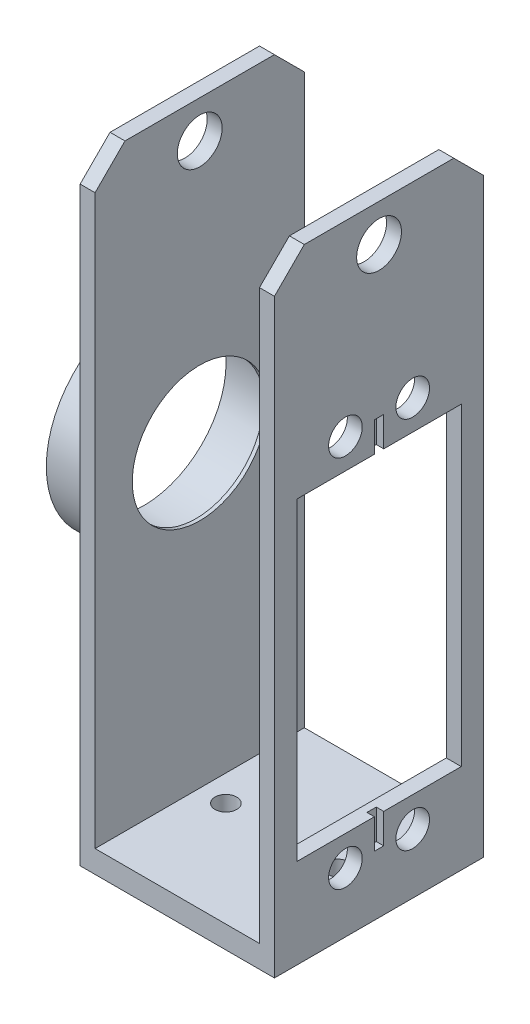
ISO-10303-21;
HEADER;
FILE_DESCRIPTION(('STEP AP214'),'2;1');
FILE_NAME('part.step','',(''),(''),'','','');
FILE_SCHEMA(('AUTOMOTIVE_DESIGN { 1 0 10303 214 1 1 1 1 }'));
ENDSEC;
DATA;
#1=APPLICATION_CONTEXT('core data for automotive mechanical design processes');
#2=APPLICATION_PROTOCOL_DEFINITION('international standard','automotive_design',2000,#1);
#3=PRODUCT_CONTEXT('',#1,'mechanical');
#4=PRODUCT('Part','Part','',(#3));
#5=PRODUCT_RELATED_PRODUCT_CATEGORY('part','',(#4));
#6=PRODUCT_DEFINITION_FORMATION('','',#4);
#7=PRODUCT_DEFINITION_CONTEXT('part definition',#1,'design');
#8=PRODUCT_DEFINITION('design','',#6,#7);
#9=PRODUCT_DEFINITION_SHAPE('','',#8);
#10=(LENGTH_UNIT() NAMED_UNIT(*) SI_UNIT(.MILLI.,.METRE.));
#11=(NAMED_UNIT(*) PLANE_ANGLE_UNIT() SI_UNIT($,.RADIAN.));
#12=(NAMED_UNIT(*) SI_UNIT($,.STERADIAN.) SOLID_ANGLE_UNIT());
#13=UNCERTAINTY_MEASURE_WITH_UNIT(LENGTH_MEASURE(1.E-05),#10,'distance_accuracy_value','');
#14=(GEOMETRIC_REPRESENTATION_CONTEXT(3) GLOBAL_UNCERTAINTY_ASSIGNED_CONTEXT((#13)) GLOBAL_UNIT_ASSIGNED_CONTEXT((#10,
#11,#12)) REPRESENTATION_CONTEXT('',''));
#15=CARTESIAN_POINT('',(0.,0.,0.));
#16=DIRECTION('',(0.,0.,1.));
#17=DIRECTION('',(1.,0.,0.));
#18=AXIS2_PLACEMENT_3D('',#15,#16,#17);
#19=CARTESIAN_POINT('',(13.,0.,0.));
#20=DIRECTION('',(1.,0.,0.));
#21=DIRECTION('',(0.,0.,-1.));
#22=AXIS2_PLACEMENT_3D('',#19,#20,#21);
#23=PLANE('',#22);
#24=CARTESIAN_POINT('',(13.,78.,0.));
#25=DIRECTION('',(-1.,0.,0.));
#26=DIRECTION('',(0.,0.,1.));
#27=AXIS2_PLACEMENT_3D('',#24,#25,#26);
#28=CIRCLE('',#27,3.);
#29=CARTESIAN_POINT('',(13.,78.,3.));
#30=VERTEX_POINT('',#29);
#31=EDGE_CURVE('E415',#30,#30,#28,.T.);
#32=ORIENTED_EDGE('',*,*,#31,.T.);
#33=EDGE_LOOP('',(#32));
#34=FACE_BOUND('',#33,.T.);
#35=CARTESIAN_POINT('',(13.,8.,4.50000000000001));
#36=DIRECTION('',(1.,0.,0.));
#37=DIRECTION('',(0.,0.,-1.));
#38=AXIS2_PLACEMENT_3D('',#35,#36,#37);
#39=CIRCLE('',#38,2.25);
#40=CARTESIAN_POINT('',(13.,8.,2.25000000000001));
#41=VERTEX_POINT('',#40);
#42=EDGE_CURVE('E353',#41,#41,#39,.T.);
#43=ORIENTED_EDGE('',*,*,#42,.F.);
#44=EDGE_LOOP('',(#43));
#45=FACE_BOUND('',#44,.T.);
#46=CARTESIAN_POINT('',(13.,58.,4.5));
#47=DIRECTION('',(1.,0.,0.));
#48=DIRECTION('',(0.,0.,-1.));
#49=AXIS2_PLACEMENT_3D('',#46,#47,#48);
#50=CIRCLE('',#49,2.25000000000001);
#51=CARTESIAN_POINT('',(13.,58.,2.25));
#52=VERTEX_POINT('',#51);
#53=EDGE_CURVE('E403',#52,#52,#50,.T.);
#54=ORIENTED_EDGE('',*,*,#53,.F.);
#55=EDGE_LOOP('',(#54));
#56=FACE_BOUND('',#55,.T.);
#57=CARTESIAN_POINT('',(13.,58.,-4.5));
#58=DIRECTION('',(1.,0.,0.));
#59=DIRECTION('',(0.,0.,-1.));
#60=AXIS2_PLACEMENT_3D('',#57,#58,#59);
#61=CIRCLE('',#60,2.25000000000001);
#62=CARTESIAN_POINT('',(13.,58.,-6.75));
#63=VERTEX_POINT('',#62);
#64=EDGE_CURVE('E388',#63,#63,#61,.T.);
#65=ORIENTED_EDGE('',*,*,#64,.F.);
#66=EDGE_LOOP('',(#65));
#67=FACE_BOUND('',#66,.T.);
#68=CARTESIAN_POINT('',(13.,8.,-4.49999999999999));
#69=DIRECTION('',(1.,0.,0.));
#70=DIRECTION('',(0.,0.,-1.));
#71=AXIS2_PLACEMENT_3D('',#68,#69,#70);
#72=CIRCLE('',#71,2.25);
#73=CARTESIAN_POINT('',(13.,8.,-6.74999999999999));
#74=VERTEX_POINT('',#73);
#75=EDGE_CURVE('E334',#74,#74,#72,.T.);
#76=ORIENTED_EDGE('',*,*,#75,.F.);
#77=EDGE_LOOP('',(#76));
#78=FACE_BOUND('',#77,.T.);
#79=DIRECTION('',(0.,1.,0.));
#80=VECTOR('',#79,1.);
#81=CARTESIAN_POINT('',(13.,0.,-14.));
#82=LINE('',#81,#80);
#83=CARTESIAN_POINT('',(13.,0.,-14.));
#84=VERTEX_POINT('',#83);
#85=CARTESIAN_POINT('',(13.,79.,-14.));
#86=VERTEX_POINT('',#85);
#87=EDGE_CURVE('E342',#84,#86,#82,.T.);
#88=ORIENTED_EDGE('',*,*,#87,.T.);
#89=DIRECTION('',(0.,0.70710678118655,0.707106781186545));
#90=VECTOR('',#89,1.);
#91=CARTESIAN_POINT('',(13.,46.4999999999997,-46.5));
#92=LINE('',#91,#90);
#93=CARTESIAN_POINT('',(13.,83.,-10.));
#94=VERTEX_POINT('',#93);
#95=EDGE_CURVE('E431',#86,#94,#92,.T.);
#96=ORIENTED_EDGE('',*,*,#95,.T.);
#97=DIRECTION('',(0.,0.,-1.));
#98=VECTOR('',#97,1.);
#99=CARTESIAN_POINT('',(13.,83.,0.));
#100=LINE('',#99,#98);
#101=CARTESIAN_POINT('',(13.,83.,9.99999999999997));
#102=VERTEX_POINT('',#101);
#103=EDGE_CURVE('E345',#102,#94,#100,.T.);
#104=ORIENTED_EDGE('',*,*,#103,.F.);
#105=DIRECTION('',(0.,0.707106781186546,-0.707106781186549));
#106=VECTOR('',#105,1.);
#107=CARTESIAN_POINT('',(13.,46.5000000000001,46.5));
#108=LINE('',#107,#106);
#109=CARTESIAN_POINT('',(13.,79.,14.));
#110=VERTEX_POINT('',#109);
#111=EDGE_CURVE('E429',#102,#110,#108,.F.);
#112=ORIENTED_EDGE('',*,*,#111,.T.);
#113=DIRECTION('',(0.,1.,0.));
#114=VECTOR('',#113,1.);
#115=CARTESIAN_POINT('',(13.,0.,14.));
#116=LINE('',#115,#114);
#117=CARTESIAN_POINT('',(13.,0.,14.));
#118=VERTEX_POINT('',#117);
#119=EDGE_CURVE('E335',#118,#110,#116,.T.);
#120=ORIENTED_EDGE('',*,*,#119,.F.);
#121=DIRECTION('',(0.,0.,-1.));
#122=VECTOR('',#121,1.);
#123=CARTESIAN_POINT('',(13.,0.,0.));
#124=LINE('',#123,#122);
#125=EDGE_CURVE('E338',#118,#84,#124,.T.);
#126=ORIENTED_EDGE('',*,*,#125,.T.);
#127=EDGE_LOOP('',(#88,#96,#104,#112,#120,#126));
#128=FACE_BOUND('',#127,.T.);
#129=DIRECTION('',(0.,0.,1.));
#130=VECTOR('',#129,1.);
#131=CARTESIAN_POINT('',(13.,54.,0.));
#132=LINE('',#131,#130);
#133=CARTESIAN_POINT('',(13.,54.,0.625000000000005));
#134=VERTEX_POINT('',#133);
#135=CARTESIAN_POINT('',(13.,54.,11.));
#136=VERTEX_POINT('',#135);
#137=EDGE_CURVE('E391',#134,#136,#132,.T.);
#138=ORIENTED_EDGE('',*,*,#137,.F.);
#139=DIRECTION('',(0.,1.,0.));
#140=VECTOR('',#139,1.);
#141=CARTESIAN_POINT('',(13.,0.,0.625000000000005));
#142=LINE('',#141,#140);
#143=CARTESIAN_POINT('',(13.,58.,0.625000000000005));
#144=VERTEX_POINT('',#143);
#145=EDGE_CURVE('E259',#134,#144,#142,.T.);
#146=ORIENTED_EDGE('',*,*,#145,.T.);
#147=DIRECTION('',(0.,0.,1.));
#148=VECTOR('',#147,1.);
#149=CARTESIAN_POINT('',(13.,58.,0.));
#150=LINE('',#149,#148);
#151=CARTESIAN_POINT('',(13.,58.,-0.624999999999995));
#152=VERTEX_POINT('',#151);
#153=EDGE_CURVE('E581',#152,#144,#150,.T.);
#154=ORIENTED_EDGE('',*,*,#153,.F.);
#155=DIRECTION('',(0.,1.,0.));
#156=VECTOR('',#155,1.);
#157=CARTESIAN_POINT('',(13.,0.,-0.624999999999995));
#158=LINE('',#157,#156);
#159=CARTESIAN_POINT('',(13.,54.,-0.624999999999995));
#160=VERTEX_POINT('',#159);
#161=EDGE_CURVE('E579',#160,#152,#158,.T.);
#162=ORIENTED_EDGE('',*,*,#161,.F.);
#163=CARTESIAN_POINT('',(13.,54.,-11.));
#164=VERTEX_POINT('',#163);
#165=EDGE_CURVE('E230',#164,#160,#132,.T.);
#166=ORIENTED_EDGE('',*,*,#165,.F.);
#167=DIRECTION('',(0.,-1.,0.));
#168=VECTOR('',#167,1.);
#169=CARTESIAN_POINT('',(13.,0.,-11.));
#170=LINE('',#169,#168);
#171=CARTESIAN_POINT('',(13.,12.,-11.));
#172=VERTEX_POINT('',#171);
#173=EDGE_CURVE('E393',#164,#172,#170,.T.);
#174=ORIENTED_EDGE('',*,*,#173,.T.);
#175=DIRECTION('',(0.,0.,1.));
#176=VECTOR('',#175,1.);
#177=CARTESIAN_POINT('',(13.,12.,0.));
#178=LINE('',#177,#176);
#179=CARTESIAN_POINT('',(13.,12.,-0.625000000000001));
#180=VERTEX_POINT('',#179);
#181=EDGE_CURVE('E397',#172,#180,#178,.T.);
#182=ORIENTED_EDGE('',*,*,#181,.T.);
#183=DIRECTION('',(0.,-1.,0.));
#184=VECTOR('',#183,1.);
#185=CARTESIAN_POINT('',(13.,12.,-0.625000000000001));
#186=LINE('',#185,#184);
#187=CARTESIAN_POINT('',(13.,8.,-0.625000000000002));
#188=VERTEX_POINT('',#187);
#189=EDGE_CURVE('E249',#180,#188,#186,.T.);
#190=ORIENTED_EDGE('',*,*,#189,.T.);
#191=DIRECTION('',(0.,0.,1.));
#192=VECTOR('',#191,1.);
#193=CARTESIAN_POINT('',(13.,8.,-0.625000000000002));
#194=LINE('',#193,#192);
#195=CARTESIAN_POINT('',(13.,8.,0.624999999999998));
#196=VERTEX_POINT('',#195);
#197=EDGE_CURVE('E252',#188,#196,#194,.T.);
#198=ORIENTED_EDGE('',*,*,#197,.T.);
#199=DIRECTION('',(0.,-1.,0.));
#200=VECTOR('',#199,1.);
#201=CARTESIAN_POINT('',(13.,12.,0.624999999999999));
#202=LINE('',#201,#200);
#203=CARTESIAN_POINT('',(13.,12.,0.624999999999999));
#204=VERTEX_POINT('',#203);
#205=EDGE_CURVE('E256',#204,#196,#202,.T.);
#206=ORIENTED_EDGE('',*,*,#205,.F.);
#207=CARTESIAN_POINT('',(13.,12.,11.));
#208=VERTEX_POINT('',#207);
#209=EDGE_CURVE('E396',#204,#208,#178,.T.);
#210=ORIENTED_EDGE('',*,*,#209,.T.);
#211=DIRECTION('',(0.,-1.,0.));
#212=VECTOR('',#211,1.);
#213=CARTESIAN_POINT('',(13.,0.,11.));
#214=LINE('',#213,#212);
#215=EDGE_CURVE('E383',#136,#208,#214,.T.);
#216=ORIENTED_EDGE('',*,*,#215,.F.);
#217=EDGE_LOOP('',(#138,#146,#154,#162,#166,#174,#182,#190,#198,#206,#210,#216));
#218=FACE_BOUND('',#217,.T.);
#219=ADVANCED_FACE('F45',(#34,#45,#56,#67,#78,#128,#218),#23,.T.);
#220=CARTESIAN_POINT('',(21.,12.,11.));
#221=DIRECTION('',(0.,1.,0.));
#222=DIRECTION('',(0.,0.,1.));
#223=AXIS2_PLACEMENT_3D('',#220,#221,#222);
#224=PLANE('',#223);
#225=DIRECTION('',(0.,0.,1.));
#226=VECTOR('',#225,1.);
#227=CARTESIAN_POINT('',(12.,12.,-0.625000000000001));
#228=LINE('',#227,#226);
#229=CARTESIAN_POINT('',(12.,12.,-0.625000000000002));
#230=VERTEX_POINT('',#229);
#231=CARTESIAN_POINT('',(12.,12.,0.624999999999999));
#232=VERTEX_POINT('',#231);
#233=EDGE_CURVE('E253',#230,#232,#228,.T.);
#234=ORIENTED_EDGE('',*,*,#233,.F.);
#235=DIRECTION('',(1.,0.,0.));
#236=VECTOR('',#235,1.);
#237=CARTESIAN_POINT('',(12.,12.,-0.625000000000001));
#238=LINE('',#237,#236);
#239=EDGE_CURVE('E245',#230,#180,#238,.T.);
#240=ORIENTED_EDGE('',*,*,#239,.T.);
#241=ORIENTED_EDGE('',*,*,#181,.F.);
#242=DIRECTION('',(-1.,0.,0.));
#243=VECTOR('',#242,1.);
#244=CARTESIAN_POINT('',(21.,12.,-11.));
#245=LINE('',#244,#243);
#246=CARTESIAN_POINT('',(11.,12.,-11.));
#247=VERTEX_POINT('',#246);
#248=EDGE_CURVE('E295',#172,#247,#245,.T.);
#249=ORIENTED_EDGE('',*,*,#248,.T.);
#250=DIRECTION('',(0.,0.,-1.));
#251=VECTOR('',#250,1.);
#252=CARTESIAN_POINT('',(11.,12.,11.));
#253=LINE('',#252,#251);
#254=CARTESIAN_POINT('',(11.,12.,11.));
#255=VERTEX_POINT('',#254);
#256=EDGE_CURVE('E306',#255,#247,#253,.T.);
#257=ORIENTED_EDGE('',*,*,#256,.F.);
#258=DIRECTION('',(-1.,0.,0.));
#259=VECTOR('',#258,1.);
#260=CARTESIAN_POINT('',(21.,12.,11.));
#261=LINE('',#260,#259);
#262=EDGE_CURVE('E312',#208,#255,#261,.T.);
#263=ORIENTED_EDGE('',*,*,#262,.F.);
#264=ORIENTED_EDGE('',*,*,#209,.F.);
#265=DIRECTION('',(1.,0.,0.));
#266=VECTOR('',#265,1.);
#267=CARTESIAN_POINT('',(12.,12.,0.624999999999999));
#268=LINE('',#267,#266);
#269=EDGE_CURVE('E238',#232,#204,#268,.T.);
#270=ORIENTED_EDGE('',*,*,#269,.F.);
#271=EDGE_LOOP('',(#234,#240,#241,#249,#257,#263,#264,#270));
#272=FACE_BOUND('',#271,.T.);
#273=ADVANCED_FACE('F478',(#272),#224,.T.);
#274=CARTESIAN_POINT('',(21.,54.,11.));
#275=DIRECTION('',(0.,1.,0.));
#276=DIRECTION('',(-1.,0.,0.));
#277=AXIS2_PLACEMENT_3D('',#274,#275,#276);
#278=PLANE('',#277);
#279=DIRECTION('',(1.,0.,0.));
#280=VECTOR('',#279,1.);
#281=CARTESIAN_POINT('',(12.,54.,0.625000000000005));
#282=LINE('',#281,#280);
#283=CARTESIAN_POINT('',(12.,54.,0.625000000000006));
#284=VERTEX_POINT('',#283);
#285=EDGE_CURVE('E231',#284,#134,#282,.T.);
#286=ORIENTED_EDGE('',*,*,#285,.T.);
#287=ORIENTED_EDGE('',*,*,#137,.T.);
#288=DIRECTION('',(-1.,0.,0.));
#289=VECTOR('',#288,1.);
#290=CARTESIAN_POINT('',(21.,54.,11.));
#291=LINE('',#290,#289);
#292=CARTESIAN_POINT('',(11.,54.,11.));
#293=VERTEX_POINT('',#292);
#294=EDGE_CURVE('E310',#136,#293,#291,.T.);
#295=ORIENTED_EDGE('',*,*,#294,.T.);
#296=DIRECTION('',(0.,0.,-1.));
#297=VECTOR('',#296,1.);
#298=CARTESIAN_POINT('',(11.,54.,11.));
#299=LINE('',#298,#297);
#300=CARTESIAN_POINT('',(11.,54.,-11.));
#301=VERTEX_POINT('',#300);
#302=EDGE_CURVE('E318',#293,#301,#299,.T.);
#303=ORIENTED_EDGE('',*,*,#302,.T.);
#304=DIRECTION('',(-1.,0.,0.));
#305=VECTOR('',#304,1.);
#306=CARTESIAN_POINT('',(21.,54.,-11.));
#307=LINE('',#306,#305);
#308=EDGE_CURVE('E308',#164,#301,#307,.T.);
#309=ORIENTED_EDGE('',*,*,#308,.F.);
#310=ORIENTED_EDGE('',*,*,#165,.T.);
#311=DIRECTION('',(1.,0.,0.));
#312=VECTOR('',#311,1.);
#313=CARTESIAN_POINT('',(12.,54.,-0.624999999999995));
#314=LINE('',#313,#312);
#315=CARTESIAN_POINT('',(12.,54.,-0.624999999999995));
#316=VERTEX_POINT('',#315);
#317=EDGE_CURVE('E210',#316,#160,#314,.T.);
#318=ORIENTED_EDGE('',*,*,#317,.F.);
#319=DIRECTION('',(0.,0.,-1.));
#320=VECTOR('',#319,1.);
#321=CARTESIAN_POINT('',(12.,54.,0.));
#322=LINE('',#321,#320);
#323=EDGE_CURVE('E217',#284,#316,#322,.T.);
#324=ORIENTED_EDGE('',*,*,#323,.F.);
#325=EDGE_LOOP('',(#286,#287,#295,#303,#309,#310,#318,#324));
#326=FACE_BOUND('',#325,.T.);
#327=ADVANCED_FACE('F227',(#326),#278,.F.);
#328=CARTESIAN_POINT('',(-13.,0.,0.));
#329=DIRECTION('',(-1.,0.,0.));
#330=DIRECTION('',(0.,0.,-1.));
#331=AXIS2_PLACEMENT_3D('',#328,#329,#330);
#332=PLANE('',#331);
#333=CARTESIAN_POINT('',(-13.,78.,0.));
#334=DIRECTION('',(-1.,0.,0.));
#335=DIRECTION('',(0.,0.,1.));
#336=AXIS2_PLACEMENT_3D('',#333,#334,#335);
#337=CIRCLE('',#336,3.);
#338=CARTESIAN_POINT('',(-13.,78.,3.));
#339=VERTEX_POINT('',#338);
#340=EDGE_CURVE('E248',#339,#339,#337,.T.);
#341=ORIENTED_EDGE('',*,*,#340,.F.);
#342=EDGE_LOOP('',(#341));
#343=FACE_BOUND('',#342,.T.);
#344=DIRECTION('',(0.,0.,-1.));
#345=VECTOR('',#344,1.);
#346=CARTESIAN_POINT('',(-13.,83.,0.));
#347=LINE('',#346,#345);
#348=CARTESIAN_POINT('',(-13.,83.,10.));
#349=VERTEX_POINT('',#348);
#350=CARTESIAN_POINT('',(-13.,83.,-9.99999999999997));
#351=VERTEX_POINT('',#350);
#352=EDGE_CURVE('E286',#349,#351,#347,.T.);
#353=ORIENTED_EDGE('',*,*,#352,.T.);
#354=DIRECTION('',(0.,0.707106781186546,0.707106781186549));
#355=VECTOR('',#354,1.);
#356=CARTESIAN_POINT('',(-13.,46.5000000000001,-46.5));
#357=LINE('',#356,#355);
#358=CARTESIAN_POINT('',(-13.,79.,-14.));
#359=VERTEX_POINT('',#358);
#360=EDGE_CURVE('E12',#351,#359,#357,.F.);
#361=ORIENTED_EDGE('',*,*,#360,.T.);
#362=DIRECTION('',(0.,1.,0.));
#363=VECTOR('',#362,1.);
#364=CARTESIAN_POINT('',(-13.,0.,-14.));
#365=LINE('',#364,#363);
#366=CARTESIAN_POINT('',(-13.,0.,-14.));
#367=VERTEX_POINT('',#366);
#368=EDGE_CURVE('E289',#367,#359,#365,.T.);
#369=ORIENTED_EDGE('',*,*,#368,.F.);
#370=DIRECTION('',(0.,0.,-1.));
#371=VECTOR('',#370,1.);
#372=CARTESIAN_POINT('',(-13.,0.,0.));
#373=LINE('',#372,#371);
#374=CARTESIAN_POINT('',(-13.,0.,14.));
#375=VERTEX_POINT('',#374);
#376=EDGE_CURVE('E292',#375,#367,#373,.T.);
#377=ORIENTED_EDGE('',*,*,#376,.F.);
#378=DIRECTION('',(0.,1.,0.));
#379=VECTOR('',#378,1.);
#380=CARTESIAN_POINT('',(-13.,0.,14.));
#381=LINE('',#380,#379);
#382=CARTESIAN_POINT('',(-13.,79.,14.));
#383=VERTEX_POINT('',#382);
#384=EDGE_CURVE('E284',#375,#383,#381,.T.);
#385=ORIENTED_EDGE('',*,*,#384,.T.);
#386=DIRECTION('',(0.,0.70710678118655,-0.707106781186545));
#387=VECTOR('',#386,1.);
#388=CARTESIAN_POINT('',(-13.,46.4999999999997,46.5));
#389=LINE('',#388,#387);
#390=EDGE_CURVE('E53',#383,#349,#389,.T.);
#391=ORIENTED_EDGE('',*,*,#390,.T.);
#392=EDGE_LOOP('',(#353,#361,#369,#377,#385,#391));
#393=FACE_BOUND('',#392,.T.);
#394=CARTESIAN_POINT('',(-13.,43.,0.));
#395=DIRECTION('',(-1.,0.,0.));
#396=DIRECTION('',(0.,0.,1.));
#397=AXIS2_PLACEMENT_3D('',#394,#395,#396);
#398=CIRCLE('',#397,13.025);
#399=CARTESIAN_POINT('',(-13.,43.,13.025));
#400=VERTEX_POINT('',#399);
#401=EDGE_CURVE('E271',#400,#400,#398,.T.);
#402=ORIENTED_EDGE('',*,*,#401,.F.);
#403=EDGE_LOOP('',(#402));
#404=FACE_BOUND('',#403,.T.);
#405=ADVANCED_FACE('F462',(#343,#393,#404),#332,.T.);
#406=CARTESIAN_POINT('',(-21.,43.,0.));
#407=DIRECTION('',(1.,0.,0.));
#408=DIRECTION('',(0.,0.,-1.));
#409=AXIS2_PLACEMENT_3D('',#406,#407,#408);
#410=CYLINDRICAL_SURFACE('',#409,11.025);
#411=CARTESIAN_POINT('',(-11.5,43.,0.));
#412=DIRECTION('',(1.,0.,0.));
#413=DIRECTION('',(0.,0.,-1.));
#414=AXIS2_PLACEMENT_3D('',#411,#412,#413);
#415=CIRCLE('',#414,11.025);
#416=CARTESIAN_POINT('',(-11.5,43.,-11.025));
#417=VERTEX_POINT('',#416);
#418=EDGE_CURVE('E400',#417,#417,#415,.F.);
#419=ORIENTED_EDGE('',*,*,#418,.F.);
#420=EDGE_LOOP('',(#419));
#421=FACE_BOUND('',#420,.T.);
#422=CARTESIAN_POINT('',(-18.5,43.,0.));
#423=DIRECTION('',(-1.,0.,0.));
#424=DIRECTION('',(0.,0.,1.));
#425=AXIS2_PLACEMENT_3D('',#422,#423,#424);
#426=CIRCLE('',#425,11.025);
#427=CARTESIAN_POINT('',(-18.5,43.,11.025));
#428=VERTEX_POINT('',#427);
#429=EDGE_CURVE('E268',#428,#428,#426,.T.);
#430=ORIENTED_EDGE('',*,*,#429,.T.);
#431=EDGE_LOOP('',(#430));
#432=FACE_BOUND('',#431,.T.);
#433=ADVANCED_FACE('F495',(#421,#432),#410,.F.);
#434=CARTESIAN_POINT('',(11.,0.,0.));
#435=DIRECTION('',(1.,0.,0.));
#436=DIRECTION('',(0.,0.,-1.));
#437=AXIS2_PLACEMENT_3D('',#434,#435,#436);
#438=PLANE('',#437);
#439=CARTESIAN_POINT('',(11.,78.,0.));
#440=DIRECTION('',(1.,0.,0.));
#441=DIRECTION('',(0.,0.,-1.));
#442=AXIS2_PLACEMENT_3D('',#439,#440,#441);
#443=CIRCLE('',#442,3.);
#444=CARTESIAN_POINT('',(11.,78.,-3.));
#445=VERTEX_POINT('',#444);
#446=EDGE_CURVE('E414',#445,#445,#443,.T.);
#447=ORIENTED_EDGE('',*,*,#446,.T.);
#448=EDGE_LOOP('',(#447));
#449=FACE_BOUND('',#448,.T.);
#450=CARTESIAN_POINT('',(11.,8.,4.50000000000001));
#451=DIRECTION('',(-1.,0.,0.));
#452=DIRECTION('',(0.,0.,1.));
#453=AXIS2_PLACEMENT_3D('',#450,#451,#452);
#454=CIRCLE('',#453,2.25);
#455=CARTESIAN_POINT('',(11.,8.,6.75000000000001));
#456=VERTEX_POINT('',#455);
#457=EDGE_CURVE('E326',#456,#456,#454,.T.);
#458=ORIENTED_EDGE('',*,*,#457,.F.);
#459=EDGE_LOOP('',(#458));
#460=FACE_BOUND('',#459,.T.);
#461=CARTESIAN_POINT('',(11.,58.,4.5));
#462=DIRECTION('',(-1.,0.,0.));
#463=DIRECTION('',(0.,0.,1.));
#464=AXIS2_PLACEMENT_3D('',#461,#462,#463);
#465=CIRCLE('',#464,2.25000000000001);
#466=CARTESIAN_POINT('',(11.,58.,6.75000000000001));
#467=VERTEX_POINT('',#466);
#468=EDGE_CURVE('E305',#467,#467,#465,.T.);
#469=ORIENTED_EDGE('',*,*,#468,.F.);
#470=EDGE_LOOP('',(#469));
#471=FACE_BOUND('',#470,.T.);
#472=CARTESIAN_POINT('',(11.,58.,-4.5));
#473=DIRECTION('',(-1.,0.,0.));
#474=DIRECTION('',(0.,0.,1.));
#475=AXIS2_PLACEMENT_3D('',#472,#473,#474);
#476=CIRCLE('',#475,2.25000000000001);
#477=CARTESIAN_POINT('',(11.,58.,-2.24999999999999));
#478=VERTEX_POINT('',#477);
#479=EDGE_CURVE('E302',#478,#478,#476,.T.);
#480=ORIENTED_EDGE('',*,*,#479,.F.);
#481=EDGE_LOOP('',(#480));
#482=FACE_BOUND('',#481,.T.);
#483=DIRECTION('',(0.,0.,-1.));
#484=VECTOR('',#483,1.);
#485=CARTESIAN_POINT('',(11.,83.,0.));
#486=LINE('',#485,#484);
#487=CARTESIAN_POINT('',(11.,83.,9.99999999999997));
#488=VERTEX_POINT('',#487);
#489=CARTESIAN_POINT('',(11.,83.,-10.));
#490=VERTEX_POINT('',#489);
#491=EDGE_CURVE('E339',#488,#490,#486,.T.);
#492=ORIENTED_EDGE('',*,*,#491,.T.);
#493=DIRECTION('',(0.,-0.70710678118655,-0.707106781186545));
#494=VECTOR('',#493,1.);
#495=CARTESIAN_POINT('',(11.,83.,-10.));
#496=LINE('',#495,#494);
#497=CARTESIAN_POINT('',(11.,79.,-14.));
#498=VERTEX_POINT('',#497);
#499=EDGE_CURVE('E422',#490,#498,#496,.T.);
#500=ORIENTED_EDGE('',*,*,#499,.T.);
#501=DIRECTION('',(0.,1.,0.));
#502=VECTOR('',#501,1.);
#503=CARTESIAN_POINT('',(11.,0.,-14.));
#504=LINE('',#503,#502);
#505=CARTESIAN_POINT('',(11.,3.,-14.));
#506=VERTEX_POINT('',#505);
#507=EDGE_CURVE('E352',#506,#498,#504,.T.);
#508=ORIENTED_EDGE('',*,*,#507,.F.);
#509=DIRECTION('',(0.,0.,1.));
#510=VECTOR('',#509,1.);
#511=CARTESIAN_POINT('',(11.,3.,-14.));
#512=LINE('',#511,#510);
#513=CARTESIAN_POINT('',(11.,3.,14.));
#514=VERTEX_POINT('',#513);
#515=EDGE_CURVE('E380',#506,#514,#512,.T.);
#516=ORIENTED_EDGE('',*,*,#515,.T.);
#517=DIRECTION('',(0.,1.,0.));
#518=VECTOR('',#517,1.);
#519=CARTESIAN_POINT('',(11.,0.,14.));
#520=LINE('',#519,#518);
#521=CARTESIAN_POINT('',(11.,79.,14.));
#522=VERTEX_POINT('',#521);
#523=EDGE_CURVE('E349',#514,#522,#520,.T.);
#524=ORIENTED_EDGE('',*,*,#523,.T.);
#525=DIRECTION('',(0.,-0.707106781186546,0.707106781186549));
#526=VECTOR('',#525,1.);
#527=CARTESIAN_POINT('',(11.,79.,14.));
#528=LINE('',#527,#526);
#529=EDGE_CURVE('E420',#522,#488,#528,.F.);
#530=ORIENTED_EDGE('',*,*,#529,.T.);
#531=EDGE_LOOP('',(#492,#500,#508,#516,#524,#530));
#532=FACE_BOUND('',#531,.T.);
#533=CARTESIAN_POINT('',(11.,8.,-4.49999999999999));
#534=DIRECTION('',(-1.,0.,0.));
#535=DIRECTION('',(0.,0.,1.));
#536=AXIS2_PLACEMENT_3D('',#533,#534,#535);
#537=CIRCLE('',#536,2.25);
#538=CARTESIAN_POINT('',(11.,8.,-2.24999999999999));
#539=VERTEX_POINT('',#538);
#540=EDGE_CURVE('E329',#539,#539,#537,.T.);
#541=ORIENTED_EDGE('',*,*,#540,.F.);
#542=EDGE_LOOP('',(#541));
#543=FACE_BOUND('',#542,.T.);
#544=ORIENTED_EDGE('',*,*,#256,.T.);
#545=DIRECTION('',(0.,1.,0.));
#546=VECTOR('',#545,1.);
#547=CARTESIAN_POINT('',(11.,12.,-11.));
#548=LINE('',#547,#546);
#549=EDGE_CURVE('E321',#247,#301,#548,.T.);
#550=ORIENTED_EDGE('',*,*,#549,.T.);
#551=ORIENTED_EDGE('',*,*,#302,.F.);
#552=DIRECTION('',(0.,1.,0.));
#553=VECTOR('',#552,1.);
#554=CARTESIAN_POINT('',(11.,12.,11.));
#555=LINE('',#554,#553);
#556=EDGE_CURVE('E315',#255,#293,#555,.T.);
#557=ORIENTED_EDGE('',*,*,#556,.F.);
#558=EDGE_LOOP('',(#544,#550,#551,#557));
#559=FACE_BOUND('',#558,.T.);
#560=ADVANCED_FACE('F492',(#449,#460,#471,#482,#532,#543,#559),#438,.F.);
#561=CARTESIAN_POINT('',(11.,3.,-14.));
#562=DIRECTION('',(0.,0.,1.));
#563=DIRECTION('',(1.,0.,0.));
#564=AXIS2_PLACEMENT_3D('',#561,#562,#563);
#565=PLANE('',#564);
#566=ORIENTED_EDGE('',*,*,#507,.T.);
#567=DIRECTION('',(1.,0.,0.));
#568=VECTOR('',#567,1.);
#569=CARTESIAN_POINT('',(13.,79.,-14.));
#570=LINE('',#569,#568);
#571=EDGE_CURVE('E427',#498,#86,#570,.T.);
#572=ORIENTED_EDGE('',*,*,#571,.T.);
#573=ORIENTED_EDGE('',*,*,#87,.F.);
#574=DIRECTION('',(-1.,0.,0.));
#575=VECTOR('',#574,1.);
#576=CARTESIAN_POINT('',(11.,0.,-14.));
#577=LINE('',#576,#575);
#578=EDGE_CURVE('E361',#84,#367,#577,.T.);
#579=ORIENTED_EDGE('',*,*,#578,.T.);
#580=ORIENTED_EDGE('',*,*,#368,.T.);
#581=DIRECTION('',(1.,0.,0.));
#582=VECTOR('',#581,1.);
#583=CARTESIAN_POINT('',(11.,79.,-14.));
#584=LINE('',#583,#582);
#585=CARTESIAN_POINT('',(-11.,79.,-14.));
#586=VERTEX_POINT('',#585);
#587=EDGE_CURVE('E424',#359,#586,#584,.T.);
#588=ORIENTED_EDGE('',*,*,#587,.T.);
#589=DIRECTION('',(0.,1.,0.));
#590=VECTOR('',#589,1.);
#591=CARTESIAN_POINT('',(-11.,0.,-14.));
#592=LINE('',#591,#590);
#593=CARTESIAN_POINT('',(-11.,3.,-14.));
#594=VERTEX_POINT('',#593);
#595=EDGE_CURVE('E287',#594,#586,#592,.T.);
#596=ORIENTED_EDGE('',*,*,#595,.F.);
#597=DIRECTION('',(-1.,0.,0.));
#598=VECTOR('',#597,1.);
#599=CARTESIAN_POINT('',(11.,3.,-14.));
#600=LINE('',#599,#598);
#601=EDGE_CURVE('E370',#506,#594,#600,.T.);
#602=ORIENTED_EDGE('',*,*,#601,.F.);
#603=EDGE_LOOP('',(#566,#572,#573,#579,#580,#588,#596,#602));
#604=FACE_BOUND('',#603,.T.);
#605=ADVANCED_FACE('F458',(#604),#565,.F.);
#606=CARTESIAN_POINT('',(11.,3.,14.));
#607=DIRECTION('',(0.,0.,1.));
#608=DIRECTION('',(1.,0.,0.));
#609=AXIS2_PLACEMENT_3D('',#606,#607,#608);
#610=PLANE('',#609);
#611=ORIENTED_EDGE('',*,*,#119,.T.);
#612=DIRECTION('',(-1.,0.,0.));
#613=VECTOR('',#612,1.);
#614=CARTESIAN_POINT('',(11.,79.,14.));
#615=LINE('',#614,#613);
#616=EDGE_CURVE('E435',#110,#522,#615,.T.);
#617=ORIENTED_EDGE('',*,*,#616,.T.);
#618=ORIENTED_EDGE('',*,*,#523,.F.);
#619=DIRECTION('',(-1.,0.,0.));
#620=VECTOR('',#619,1.);
#621=CARTESIAN_POINT('',(11.,3.,14.));
#622=LINE('',#621,#620);
#623=CARTESIAN_POINT('',(-11.,3.,14.));
#624=VERTEX_POINT('',#623);
#625=EDGE_CURVE('E377',#514,#624,#622,.T.);
#626=ORIENTED_EDGE('',*,*,#625,.T.);
#627=DIRECTION('',(0.,1.,0.));
#628=VECTOR('',#627,1.);
#629=CARTESIAN_POINT('',(-11.,0.,14.));
#630=LINE('',#629,#628);
#631=CARTESIAN_POINT('',(-11.,79.,14.));
#632=VERTEX_POINT('',#631);
#633=EDGE_CURVE('E281',#624,#632,#630,.T.);
#634=ORIENTED_EDGE('',*,*,#633,.T.);
#635=DIRECTION('',(-1.,0.,0.));
#636=VECTOR('',#635,1.);
#637=CARTESIAN_POINT('',(-13.,79.,14.));
#638=LINE('',#637,#636);
#639=EDGE_CURVE('E433',#632,#383,#638,.T.);
#640=ORIENTED_EDGE('',*,*,#639,.T.);
#641=ORIENTED_EDGE('',*,*,#384,.F.);
#642=DIRECTION('',(-1.,0.,0.));
#643=VECTOR('',#642,1.);
#644=CARTESIAN_POINT('',(11.,0.,14.));
#645=LINE('',#644,#643);
#646=EDGE_CURVE('E374',#118,#375,#645,.T.);
#647=ORIENTED_EDGE('',*,*,#646,.F.);
#648=EDGE_LOOP('',(#611,#617,#618,#626,#634,#640,#641,#647));
#649=FACE_BOUND('',#648,.T.);
#650=ADVANCED_FACE('F470',(#649),#610,.T.);
#651=CARTESIAN_POINT('',(0.,3.,0.));
#652=DIRECTION('',(0.,1.,0.));
#653=DIRECTION('',(0.,0.,1.));
#654=AXIS2_PLACEMENT_3D('',#651,#652,#653);
#655=PLANE('',#654);
#656=CARTESIAN_POINT('',(-7.5,3.,0.));
#657=DIRECTION('',(0.,-1.,0.));
#658=DIRECTION('',(0.,0.,-1.));
#659=AXIS2_PLACEMENT_3D('',#656,#657,#658);
#660=CIRCLE('',#659,1.45);
#661=CARTESIAN_POINT('',(-7.5,3.,-1.45));
#662=VERTEX_POINT('',#661);
#663=EDGE_CURVE('E358',#662,#662,#660,.T.);
#664=ORIENTED_EDGE('',*,*,#663,.T.);
#665=EDGE_LOOP('',(#664));
#666=FACE_BOUND('',#665,.T.);
#667=CARTESIAN_POINT('',(7.5,3.,0.));
#668=DIRECTION('',(0.,-1.,0.));
#669=DIRECTION('',(0.,0.,-1.));
#670=AXIS2_PLACEMENT_3D('',#667,#668,#669);
#671=CIRCLE('',#670,1.45);
#672=CARTESIAN_POINT('',(7.5,3.,-1.45));
#673=VERTEX_POINT('',#672);
#674=EDGE_CURVE('E365',#673,#673,#671,.T.);
#675=ORIENTED_EDGE('',*,*,#674,.T.);
#676=EDGE_LOOP('',(#675));
#677=FACE_BOUND('',#676,.T.);
#678=ORIENTED_EDGE('',*,*,#601,.T.);
#679=DIRECTION('',(0.,0.,1.));
#680=VECTOR('',#679,1.);
#681=CARTESIAN_POINT('',(-11.,3.,-14.));
#682=LINE('',#681,#680);
#683=EDGE_CURVE('E373',#594,#624,#682,.T.);
#684=ORIENTED_EDGE('',*,*,#683,.T.);
#685=ORIENTED_EDGE('',*,*,#625,.F.);
#686=ORIENTED_EDGE('',*,*,#515,.F.);
#687=EDGE_LOOP('',(#678,#684,#685,#686));
#688=FACE_BOUND('',#687,.T.);
#689=ADVANCED_FACE('F509',(#666,#677,#688),#655,.T.);
#690=CARTESIAN_POINT('',(0.,0.,0.));
#691=DIRECTION('',(0.,1.,0.));
#692=DIRECTION('',(0.,0.,1.));
#693=AXIS2_PLACEMENT_3D('',#690,#691,#692);
#694=PLANE('',#693);
#695=CARTESIAN_POINT('',(-7.5,0.,0.));
#696=DIRECTION('',(0.,-1.,0.));
#697=DIRECTION('',(0.,0.,-1.));
#698=AXIS2_PLACEMENT_3D('',#695,#696,#697);
#699=CIRCLE('',#698,1.45);
#700=CARTESIAN_POINT('',(-7.5,0.,-1.45));
#701=VERTEX_POINT('',#700);
#702=EDGE_CURVE('E362',#701,#701,#699,.T.);
#703=ORIENTED_EDGE('',*,*,#702,.F.);
#704=EDGE_LOOP('',(#703));
#705=FACE_BOUND('',#704,.T.);
#706=CARTESIAN_POINT('',(7.5,0.,0.));
#707=DIRECTION('',(0.,-1.,0.));
#708=DIRECTION('',(0.,0.,-1.));
#709=AXIS2_PLACEMENT_3D('',#706,#707,#708);
#710=CIRCLE('',#709,1.45);
#711=CARTESIAN_POINT('',(7.5,0.,-1.45));
#712=VERTEX_POINT('',#711);
#713=EDGE_CURVE('E348',#712,#712,#710,.T.);
#714=ORIENTED_EDGE('',*,*,#713,.F.);
#715=EDGE_LOOP('',(#714));
#716=FACE_BOUND('',#715,.T.);
#717=ORIENTED_EDGE('',*,*,#578,.F.);
#718=ORIENTED_EDGE('',*,*,#125,.F.);
#719=ORIENTED_EDGE('',*,*,#646,.T.);
#720=ORIENTED_EDGE('',*,*,#376,.T.);
#721=EDGE_LOOP('',(#717,#718,#719,#720));
#722=FACE_BOUND('',#721,.T.);
#723=ADVANCED_FACE('F465',(#705,#716,#722),#694,.F.);
#724=CARTESIAN_POINT('',(7.5,3.,0.));
#725=DIRECTION('',(0.,-1.,0.));
#726=DIRECTION('',(0.,0.,-1.));
#727=AXIS2_PLACEMENT_3D('',#724,#725,#726);
#728=CYLINDRICAL_SURFACE('',#727,1.45);
#729=ORIENTED_EDGE('',*,*,#674,.F.);
#730=EDGE_LOOP('',(#729));
#731=FACE_BOUND('',#730,.T.);
#732=ORIENTED_EDGE('',*,*,#713,.T.);
#733=EDGE_LOOP('',(#732));
#734=FACE_BOUND('',#733,.T.);
#735=ADVANCED_FACE('F504',(#731,#734),#728,.F.);
#736=CARTESIAN_POINT('',(-7.5,3.,0.));
#737=DIRECTION('',(0.,-1.,0.));
#738=DIRECTION('',(0.,0.,-1.));
#739=AXIS2_PLACEMENT_3D('',#736,#737,#738);
#740=CYLINDRICAL_SURFACE('',#739,1.45);
#741=ORIENTED_EDGE('',*,*,#663,.F.);
#742=EDGE_LOOP('',(#741));
#743=FACE_BOUND('',#742,.T.);
#744=ORIENTED_EDGE('',*,*,#702,.T.);
#745=EDGE_LOOP('',(#744));
#746=FACE_BOUND('',#745,.T.);
#747=ADVANCED_FACE('F500',(#743,#746),#740,.F.);
#748=CARTESIAN_POINT('',(13.,83.,0.));
#749=DIRECTION('',(0.,1.,0.));
#750=DIRECTION('',(0.,0.,1.));
#751=AXIS2_PLACEMENT_3D('',#748,#749,#750);
#752=PLANE('',#751);
#753=ORIENTED_EDGE('',*,*,#103,.T.);
#754=DIRECTION('',(-1.,0.,0.));
#755=VECTOR('',#754,1.);
#756=CARTESIAN_POINT('',(11.,83.,-10.));
#757=LINE('',#756,#755);
#758=EDGE_CURVE('E417',#94,#490,#757,.T.);
#759=ORIENTED_EDGE('',*,*,#758,.T.);
#760=ORIENTED_EDGE('',*,*,#491,.F.);
#761=DIRECTION('',(1.,0.,0.));
#762=VECTOR('',#761,1.);
#763=CARTESIAN_POINT('',(13.,83.,9.99999999999997));
#764=LINE('',#763,#762);
#765=EDGE_CURVE('E410',#488,#102,#764,.T.);
#766=ORIENTED_EDGE('',*,*,#765,.T.);
#767=EDGE_LOOP('',(#753,#759,#760,#766));
#768=FACE_BOUND('',#767,.T.);
#769=ADVANCED_FACE('F497',(#768),#752,.T.);
#770=CARTESIAN_POINT('',(21.,8.,-4.49999999999999));
#771=DIRECTION('',(-1.,0.,0.));
#772=DIRECTION('',(0.,0.,1.));
#773=AXIS2_PLACEMENT_3D('',#770,#771,#772);
#774=CYLINDRICAL_SURFACE('',#773,2.25);
#775=ORIENTED_EDGE('',*,*,#75,.T.);
#776=EDGE_LOOP('',(#775));
#777=FACE_BOUND('',#776,.T.);
#778=ORIENTED_EDGE('',*,*,#540,.T.);
#779=EDGE_LOOP('',(#778));
#780=FACE_BOUND('',#779,.T.);
#781=ADVANCED_FACE('F490',(#777,#780),#774,.F.);
#782=CARTESIAN_POINT('',(21.,12.,-11.));
#783=DIRECTION('',(0.,0.,1.));
#784=DIRECTION('',(1.,0.,0.));
#785=AXIS2_PLACEMENT_3D('',#782,#783,#784);
#786=PLANE('',#785);
#787=ORIENTED_EDGE('',*,*,#308,.T.);
#788=ORIENTED_EDGE('',*,*,#549,.F.);
#789=ORIENTED_EDGE('',*,*,#248,.F.);
#790=ORIENTED_EDGE('',*,*,#173,.F.);
#791=EDGE_LOOP('',(#787,#788,#789,#790));
#792=FACE_BOUND('',#791,.T.);
#793=ADVANCED_FACE('F573',(#792),#786,.T.);
#794=CARTESIAN_POINT('',(21.,12.,11.));
#795=DIRECTION('',(0.,0.,1.));
#796=DIRECTION('',(1.,0.,0.));
#797=AXIS2_PLACEMENT_3D('',#794,#795,#796);
#798=PLANE('',#797);
#799=ORIENTED_EDGE('',*,*,#215,.T.);
#800=ORIENTED_EDGE('',*,*,#262,.T.);
#801=ORIENTED_EDGE('',*,*,#556,.T.);
#802=ORIENTED_EDGE('',*,*,#294,.F.);
#803=EDGE_LOOP('',(#799,#800,#801,#802));
#804=FACE_BOUND('',#803,.T.);
#805=ADVANCED_FACE('F555',(#804),#798,.F.);
#806=CARTESIAN_POINT('',(21.,58.,-4.5));
#807=DIRECTION('',(-1.,0.,0.));
#808=DIRECTION('',(0.,0.,1.));
#809=AXIS2_PLACEMENT_3D('',#806,#807,#808);
#810=CYLINDRICAL_SURFACE('',#809,2.25000000000001);
#811=ORIENTED_EDGE('',*,*,#64,.T.);
#812=EDGE_LOOP('',(#811));
#813=FACE_BOUND('',#812,.T.);
#814=ORIENTED_EDGE('',*,*,#479,.T.);
#815=EDGE_LOOP('',(#814));
#816=FACE_BOUND('',#815,.T.);
#817=ADVANCED_FACE('F606',(#813,#816),#810,.F.);
#818=CARTESIAN_POINT('',(21.,58.,4.5));
#819=DIRECTION('',(-1.,0.,0.));
#820=DIRECTION('',(0.,0.,1.));
#821=AXIS2_PLACEMENT_3D('',#818,#819,#820);
#822=CYLINDRICAL_SURFACE('',#821,2.25000000000001);
#823=ORIENTED_EDGE('',*,*,#53,.T.);
#824=EDGE_LOOP('',(#823));
#825=FACE_BOUND('',#824,.T.);
#826=ORIENTED_EDGE('',*,*,#468,.T.);
#827=EDGE_LOOP('',(#826));
#828=FACE_BOUND('',#827,.T.);
#829=ADVANCED_FACE('F608',(#825,#828),#822,.F.);
#830=CARTESIAN_POINT('',(21.,8.,4.50000000000001));
#831=DIRECTION('',(-1.,0.,0.));
#832=DIRECTION('',(0.,0.,1.));
#833=AXIS2_PLACEMENT_3D('',#830,#831,#832);
#834=CYLINDRICAL_SURFACE('',#833,2.25);
#835=ORIENTED_EDGE('',*,*,#42,.T.);
#836=EDGE_LOOP('',(#835));
#837=FACE_BOUND('',#836,.T.);
#838=ORIENTED_EDGE('',*,*,#457,.T.);
#839=EDGE_LOOP('',(#838));
#840=FACE_BOUND('',#839,.T.);
#841=ADVANCED_FACE('F615',(#837,#840),#834,.F.);
#842=CARTESIAN_POINT('',(-13.,83.,0.));
#843=DIRECTION('',(0.,-1.,0.));
#844=DIRECTION('',(0.,0.,-1.));
#845=AXIS2_PLACEMENT_3D('',#842,#843,#844);
#846=PLANE('',#845);
#847=DIRECTION('',(0.,0.,-1.));
#848=VECTOR('',#847,1.);
#849=CARTESIAN_POINT('',(-11.,83.,0.));
#850=LINE('',#849,#848);
#851=CARTESIAN_POINT('',(-11.,83.,10.));
#852=VERTEX_POINT('',#851);
#853=CARTESIAN_POINT('',(-11.,83.,-9.99999999999997));
#854=VERTEX_POINT('',#853);
#855=EDGE_CURVE('E298',#852,#854,#850,.T.);
#856=ORIENTED_EDGE('',*,*,#855,.T.);
#857=DIRECTION('',(-1.,0.,0.));
#858=VECTOR('',#857,1.);
#859=CARTESIAN_POINT('',(-13.,83.,-9.99999999999997));
#860=LINE('',#859,#858);
#861=EDGE_CURVE('E60',#854,#351,#860,.T.);
#862=ORIENTED_EDGE('',*,*,#861,.T.);
#863=ORIENTED_EDGE('',*,*,#352,.F.);
#864=DIRECTION('',(1.,0.,0.));
#865=VECTOR('',#864,1.);
#866=CARTESIAN_POINT('',(-11.,83.,10.));
#867=LINE('',#866,#865);
#868=EDGE_CURVE('E442',#349,#852,#867,.T.);
#869=ORIENTED_EDGE('',*,*,#868,.T.);
#870=EDGE_LOOP('',(#856,#862,#863,#869));
#871=FACE_BOUND('',#870,.T.);
#872=ADVANCED_FACE('F447',(#871),#846,.F.);
#873=CARTESIAN_POINT('',(-11.,0.,0.));
#874=DIRECTION('',(-1.,0.,0.));
#875=DIRECTION('',(0.,0.,-1.));
#876=AXIS2_PLACEMENT_3D('',#873,#874,#875);
#877=PLANE('',#876);
#878=CARTESIAN_POINT('',(-11.,78.,0.));
#879=DIRECTION('',(-1.,0.,0.));
#880=DIRECTION('',(0.,0.,1.));
#881=AXIS2_PLACEMENT_3D('',#878,#879,#880);
#882=CIRCLE('',#881,3.);
#883=CARTESIAN_POINT('',(-11.,78.,3.));
#884=VERTEX_POINT('',#883);
#885=EDGE_CURVE('E411',#884,#884,#882,.T.);
#886=ORIENTED_EDGE('',*,*,#885,.T.);
#887=EDGE_LOOP('',(#886));
#888=FACE_BOUND('',#887,.T.);
#889=ORIENTED_EDGE('',*,*,#595,.T.);
#890=DIRECTION('',(0.,-0.707106781186546,-0.707106781186549));
#891=VECTOR('',#890,1.);
#892=CARTESIAN_POINT('',(-11.,79.,-14.));
#893=LINE('',#892,#891);
#894=EDGE_CURVE('E440',#586,#854,#893,.F.);
#895=ORIENTED_EDGE('',*,*,#894,.T.);
#896=ORIENTED_EDGE('',*,*,#855,.F.);
#897=DIRECTION('',(0.,-0.70710678118655,0.707106781186545));
#898=VECTOR('',#897,1.);
#899=CARTESIAN_POINT('',(-11.,83.,10.));
#900=LINE('',#899,#898);
#901=EDGE_CURVE('E438',#852,#632,#900,.T.);
#902=ORIENTED_EDGE('',*,*,#901,.T.);
#903=ORIENTED_EDGE('',*,*,#633,.F.);
#904=ORIENTED_EDGE('',*,*,#683,.F.);
#905=EDGE_LOOP('',(#889,#895,#896,#902,#903,#904));
#906=FACE_BOUND('',#905,.T.);
#907=CARTESIAN_POINT('',(-11.,43.,0.));
#908=DIRECTION('',(1.,0.,0.));
#909=DIRECTION('',(0.,0.,-1.));
#910=AXIS2_PLACEMENT_3D('',#907,#908,#909);
#911=CIRCLE('',#910,9.025);
#912=CARTESIAN_POINT('',(-11.,43.,-9.025));
#913=VERTEX_POINT('',#912);
#914=EDGE_CURVE('E275',#913,#913,#911,.T.);
#915=ORIENTED_EDGE('',*,*,#914,.F.);
#916=EDGE_LOOP('',(#915));
#917=FACE_BOUND('',#916,.T.);
#918=ADVANCED_FACE('F450',(#888,#906,#917),#877,.F.);
#919=CARTESIAN_POINT('',(-11.5,43.,0.));
#920=DIRECTION('',(1.,0.,0.));
#921=DIRECTION('',(0.,0.,-1.));
#922=AXIS2_PLACEMENT_3D('',#919,#920,#921);
#923=PLANE('',#922);
#924=CARTESIAN_POINT('',(-11.5,43.,0.));
#925=DIRECTION('',(1.,0.,0.));
#926=DIRECTION('',(0.,0.,-1.));
#927=AXIS2_PLACEMENT_3D('',#924,#925,#926);
#928=CIRCLE('',#927,9.025);
#929=CARTESIAN_POINT('',(-11.5,43.,-9.025));
#930=VERTEX_POINT('',#929);
#931=EDGE_CURVE('E278',#930,#930,#928,.T.);
#932=ORIENTED_EDGE('',*,*,#931,.T.);
#933=EDGE_LOOP('',(#932));
#934=FACE_BOUND('',#933,.T.);
#935=ORIENTED_EDGE('',*,*,#418,.T.);
#936=EDGE_LOOP('',(#935));
#937=FACE_BOUND('',#936,.T.);
#938=ADVANCED_FACE('F691',(#934,#937),#923,.F.);
#939=CARTESIAN_POINT('',(-11.5,43.,0.));
#940=DIRECTION('',(1.,0.,0.));
#941=DIRECTION('',(0.,0.,-1.));
#942=AXIS2_PLACEMENT_3D('',#939,#940,#941);
#943=CYLINDRICAL_SURFACE('',#942,9.025);
#944=ORIENTED_EDGE('',*,*,#931,.F.);
#945=EDGE_LOOP('',(#944));
#946=FACE_BOUND('',#945,.T.);
#947=ORIENTED_EDGE('',*,*,#914,.T.);
#948=EDGE_LOOP('',(#947));
#949=FACE_BOUND('',#948,.T.);
#950=ADVANCED_FACE('F696',(#946,#949),#943,.F.);
#951=CARTESIAN_POINT('',(-18.5,43.,0.));
#952=DIRECTION('',(-1.,0.,0.));
#953=DIRECTION('',(0.,0.,1.));
#954=AXIS2_PLACEMENT_3D('',#951,#952,#953);
#955=PLANE('',#954);
#956=CARTESIAN_POINT('',(-18.5,43.,0.));
#957=DIRECTION('',(-1.,0.,0.));
#958=DIRECTION('',(0.,0.,1.));
#959=AXIS2_PLACEMENT_3D('',#956,#957,#958);
#960=CIRCLE('',#959,13.025);
#961=CARTESIAN_POINT('',(-18.5,43.,13.025));
#962=VERTEX_POINT('',#961);
#963=EDGE_CURVE('E272',#962,#962,#960,.T.);
#964=ORIENTED_EDGE('',*,*,#963,.T.);
#965=EDGE_LOOP('',(#964));
#966=FACE_BOUND('',#965,.T.);
#967=ORIENTED_EDGE('',*,*,#429,.F.);
#968=EDGE_LOOP('',(#967));
#969=FACE_BOUND('',#968,.T.);
#970=ADVANCED_FACE('F708',(#966,#969),#955,.T.);
#971=CARTESIAN_POINT('',(-18.5,43.,0.));
#972=DIRECTION('',(1.,0.,0.));
#973=DIRECTION('',(0.,0.,-1.));
#974=AXIS2_PLACEMENT_3D('',#971,#972,#973);
#975=CYLINDRICAL_SURFACE('',#974,13.025);
#976=ORIENTED_EDGE('',*,*,#963,.F.);
#977=EDGE_LOOP('',(#976));
#978=FACE_BOUND('',#977,.T.);
#979=ORIENTED_EDGE('',*,*,#401,.T.);
#980=EDGE_LOOP('',(#979));
#981=FACE_BOUND('',#980,.T.);
#982=ADVANCED_FACE('F731',(#978,#981),#975,.T.);
#983=CARTESIAN_POINT('',(12.,0.,0.625000000000005));
#984=DIRECTION('',(0.,0.,-1.));
#985=DIRECTION('',(-1.,0.,0.));
#986=AXIS2_PLACEMENT_3D('',#983,#984,#985);
#987=PLANE('',#986);
#988=ORIENTED_EDGE('',*,*,#145,.F.);
#989=ORIENTED_EDGE('',*,*,#285,.F.);
#990=DIRECTION('',(0.,1.,0.));
#991=VECTOR('',#990,1.);
#992=CARTESIAN_POINT('',(12.,0.,0.625000000000005));
#993=LINE('',#992,#991);
#994=CARTESIAN_POINT('',(12.,58.,0.625000000000005));
#995=VERTEX_POINT('',#994);
#996=EDGE_CURVE('E221',#284,#995,#993,.T.);
#997=ORIENTED_EDGE('',*,*,#996,.T.);
#998=DIRECTION('',(1.,0.,0.));
#999=VECTOR('',#998,1.);
#1000=CARTESIAN_POINT('',(12.,58.,0.625000000000005));
#1001=LINE('',#1000,#999);
#1002=EDGE_CURVE('E233',#995,#144,#1001,.T.);
#1003=ORIENTED_EDGE('',*,*,#1002,.T.);
#1004=EDGE_LOOP('',(#988,#989,#997,#1003));
#1005=FACE_BOUND('',#1004,.T.);
#1006=ADVANCED_FACE('F575',(#1005),#987,.T.);
#1007=CARTESIAN_POINT('',(12.,58.,0.));
#1008=DIRECTION('',(0.,1.,0.));
#1009=DIRECTION('',(-1.,0.,0.));
#1010=AXIS2_PLACEMENT_3D('',#1007,#1008,#1009);
#1011=PLANE('',#1010);
#1012=ORIENTED_EDGE('',*,*,#153,.T.);
#1013=ORIENTED_EDGE('',*,*,#1002,.F.);
#1014=DIRECTION('',(0.,0.,1.));
#1015=VECTOR('',#1014,1.);
#1016=CARTESIAN_POINT('',(12.,58.,0.));
#1017=LINE('',#1016,#1015);
#1018=CARTESIAN_POINT('',(12.,58.,-0.624999999999995));
#1019=VERTEX_POINT('',#1018);
#1020=EDGE_CURVE('E216',#1019,#995,#1017,.T.);
#1021=ORIENTED_EDGE('',*,*,#1020,.F.);
#1022=DIRECTION('',(1.,0.,0.));
#1023=VECTOR('',#1022,1.);
#1024=CARTESIAN_POINT('',(12.,58.,-0.624999999999995));
#1025=LINE('',#1024,#1023);
#1026=EDGE_CURVE('E212',#1019,#152,#1025,.T.);
#1027=ORIENTED_EDGE('',*,*,#1026,.T.);
#1028=EDGE_LOOP('',(#1012,#1013,#1021,#1027));
#1029=FACE_BOUND('',#1028,.T.);
#1030=ADVANCED_FACE('F763',(#1029),#1011,.F.);
#1031=CARTESIAN_POINT('',(12.,0.,-0.624999999999995));
#1032=DIRECTION('',(0.,0.,-1.));
#1033=DIRECTION('',(-1.,0.,0.));
#1034=AXIS2_PLACEMENT_3D('',#1031,#1032,#1033);
#1035=PLANE('',#1034);
#1036=ORIENTED_EDGE('',*,*,#161,.T.);
#1037=ORIENTED_EDGE('',*,*,#1026,.F.);
#1038=DIRECTION('',(0.,1.,0.));
#1039=VECTOR('',#1038,1.);
#1040=CARTESIAN_POINT('',(12.,0.,-0.624999999999995));
#1041=LINE('',#1040,#1039);
#1042=EDGE_CURVE('E205',#316,#1019,#1041,.T.);
#1043=ORIENTED_EDGE('',*,*,#1042,.F.);
#1044=ORIENTED_EDGE('',*,*,#317,.T.);
#1045=EDGE_LOOP('',(#1036,#1037,#1043,#1044));
#1046=FACE_BOUND('',#1045,.T.);
#1047=ADVANCED_FACE('F208',(#1046),#1035,.F.);
#1048=CARTESIAN_POINT('',(12.,0.,0.));
#1049=DIRECTION('',(1.,0.,0.));
#1050=DIRECTION('',(0.,0.,-1.));
#1051=AXIS2_PLACEMENT_3D('',#1048,#1049,#1050);
#1052=PLANE('',#1051);
#1053=ORIENTED_EDGE('',*,*,#996,.F.);
#1054=ORIENTED_EDGE('',*,*,#323,.T.);
#1055=ORIENTED_EDGE('',*,*,#1042,.T.);
#1056=ORIENTED_EDGE('',*,*,#1020,.T.);
#1057=EDGE_LOOP('',(#1053,#1054,#1055,#1056));
#1058=FACE_BOUND('',#1057,.T.);
#1059=ADVANCED_FACE('F220',(#1058),#1052,.T.);
#1060=CARTESIAN_POINT('',(12.,12.,-0.625000000000001));
#1061=DIRECTION('',(0.,0.,1.));
#1062=DIRECTION('',(1.,0.,0.));
#1063=AXIS2_PLACEMENT_3D('',#1060,#1061,#1062);
#1064=PLANE('',#1063);
#1065=ORIENTED_EDGE('',*,*,#189,.F.);
#1066=ORIENTED_EDGE('',*,*,#239,.F.);
#1067=DIRECTION('',(0.,-1.,0.));
#1068=VECTOR('',#1067,1.);
#1069=CARTESIAN_POINT('',(12.,12.,-0.625000000000001));
#1070=LINE('',#1069,#1068);
#1071=CARTESIAN_POINT('',(12.,8.,-0.625000000000002));
#1072=VERTEX_POINT('',#1071);
#1073=EDGE_CURVE('E240',#230,#1072,#1070,.T.);
#1074=ORIENTED_EDGE('',*,*,#1073,.T.);
#1075=DIRECTION('',(1.,0.,0.));
#1076=VECTOR('',#1075,1.);
#1077=CARTESIAN_POINT('',(12.,8.,-0.625000000000002));
#1078=LINE('',#1077,#1076);
#1079=EDGE_CURVE('E243',#1072,#188,#1078,.T.);
#1080=ORIENTED_EDGE('',*,*,#1079,.T.);
#1081=EDGE_LOOP('',(#1065,#1066,#1074,#1080));
#1082=FACE_BOUND('',#1081,.T.);
#1083=ADVANCED_FACE('F571',(#1082),#1064,.T.);
#1084=CARTESIAN_POINT('',(12.,8.,-0.625000000000002));
#1085=DIRECTION('',(0.,1.,0.));
#1086=DIRECTION('',(-1.,0.,0.));
#1087=AXIS2_PLACEMENT_3D('',#1084,#1085,#1086);
#1088=PLANE('',#1087);
#1089=ORIENTED_EDGE('',*,*,#197,.F.);
#1090=ORIENTED_EDGE('',*,*,#1079,.F.);
#1091=DIRECTION('',(0.,0.,1.));
#1092=VECTOR('',#1091,1.);
#1093=CARTESIAN_POINT('',(12.,8.,-0.625000000000002));
#1094=LINE('',#1093,#1092);
#1095=CARTESIAN_POINT('',(12.,8.,0.624999999999998));
#1096=VERTEX_POINT('',#1095);
#1097=EDGE_CURVE('E261',#1072,#1096,#1094,.T.);
#1098=ORIENTED_EDGE('',*,*,#1097,.T.);
#1099=DIRECTION('',(1.,0.,0.));
#1100=VECTOR('',#1099,1.);
#1101=CARTESIAN_POINT('',(12.,8.,0.624999999999998));
#1102=LINE('',#1101,#1100);
#1103=EDGE_CURVE('E241',#1096,#196,#1102,.T.);
#1104=ORIENTED_EDGE('',*,*,#1103,.T.);
#1105=EDGE_LOOP('',(#1089,#1090,#1098,#1104));
#1106=FACE_BOUND('',#1105,.T.);
#1107=ADVANCED_FACE('F797',(#1106),#1088,.T.);
#1108=CARTESIAN_POINT('',(12.,12.,0.624999999999999));
#1109=DIRECTION('',(0.,0.,1.));
#1110=DIRECTION('',(0.,-1.,0.));
#1111=AXIS2_PLACEMENT_3D('',#1108,#1109,#1110);
#1112=PLANE('',#1111);
#1113=ORIENTED_EDGE('',*,*,#205,.T.);
#1114=ORIENTED_EDGE('',*,*,#1103,.F.);
#1115=DIRECTION('',(0.,-1.,0.));
#1116=VECTOR('',#1115,1.);
#1117=CARTESIAN_POINT('',(12.,12.,0.624999999999999));
#1118=LINE('',#1117,#1116);
#1119=EDGE_CURVE('E263',#232,#1096,#1118,.T.);
#1120=ORIENTED_EDGE('',*,*,#1119,.F.);
#1121=ORIENTED_EDGE('',*,*,#269,.T.);
#1122=EDGE_LOOP('',(#1113,#1114,#1120,#1121));
#1123=FACE_BOUND('',#1122,.T.);
#1124=ADVANCED_FACE('F563',(#1123),#1112,.F.);
#1125=CARTESIAN_POINT('',(12.,0.,0.));
#1126=DIRECTION('',(1.,0.,0.));
#1127=DIRECTION('',(0.,0.,-1.));
#1128=AXIS2_PLACEMENT_3D('',#1125,#1126,#1127);
#1129=PLANE('',#1128);
#1130=ORIENTED_EDGE('',*,*,#233,.T.);
#1131=ORIENTED_EDGE('',*,*,#1119,.T.);
#1132=ORIENTED_EDGE('',*,*,#1097,.F.);
#1133=ORIENTED_EDGE('',*,*,#1073,.F.);
#1134=EDGE_LOOP('',(#1130,#1131,#1132,#1133));
#1135=FACE_BOUND('',#1134,.T.);
#1136=ADVANCED_FACE('F567',(#1135),#1129,.T.);
#1137=CARTESIAN_POINT('',(13.,78.,0.));
#1138=DIRECTION('',(-1.,0.,0.));
#1139=DIRECTION('',(0.,0.,1.));
#1140=AXIS2_PLACEMENT_3D('',#1137,#1138,#1139);
#1141=CYLINDRICAL_SURFACE('',#1140,3.);
#1142=ORIENTED_EDGE('',*,*,#340,.T.);
#1143=EDGE_LOOP('',(#1142));
#1144=FACE_BOUND('',#1143,.T.);
#1145=ORIENTED_EDGE('',*,*,#885,.F.);
#1146=EDGE_LOOP('',(#1145));
#1147=FACE_BOUND('',#1146,.T.);
#1148=ADVANCED_FACE('F596',(#1144,#1147),#1141,.F.);
#1149=ORIENTED_EDGE('',*,*,#31,.F.);
#1150=EDGE_LOOP('',(#1149));
#1151=FACE_BOUND('',#1150,.T.);
#1152=ORIENTED_EDGE('',*,*,#446,.F.);
#1153=EDGE_LOOP('',(#1152));
#1154=FACE_BOUND('',#1153,.T.);
#1155=ADVANCED_FACE('F523',(#1151,#1154),#1141,.F.);
#1156=CARTESIAN_POINT('',(13.,83.,-10.));
#1157=DIRECTION('',(0.,0.707106781186545,-0.70710678118655));
#1158=DIRECTION('',(1.,0.,0.));
#1159=AXIS2_PLACEMENT_3D('',#1156,#1157,#1158);
#1160=PLANE('',#1159);
#1161=ORIENTED_EDGE('',*,*,#95,.F.);
#1162=ORIENTED_EDGE('',*,*,#571,.F.);
#1163=ORIENTED_EDGE('',*,*,#499,.F.);
#1164=ORIENTED_EDGE('',*,*,#758,.F.);
#1165=EDGE_LOOP('',(#1161,#1162,#1163,#1164));
#1166=FACE_BOUND('',#1165,.T.);
#1167=ADVANCED_FACE('F520',(#1166),#1160,.T.);
#1168=CARTESIAN_POINT('',(11.,79.,14.));
#1169=DIRECTION('',(0.,-0.707106781186549,-0.707106781186546));
#1170=DIRECTION('',(-1.,0.,0.));
#1171=AXIS2_PLACEMENT_3D('',#1168,#1169,#1170);
#1172=PLANE('',#1171);
#1173=ORIENTED_EDGE('',*,*,#111,.F.);
#1174=ORIENTED_EDGE('',*,*,#765,.F.);
#1175=ORIENTED_EDGE('',*,*,#529,.F.);
#1176=ORIENTED_EDGE('',*,*,#616,.F.);
#1177=EDGE_LOOP('',(#1173,#1174,#1175,#1176));
#1178=FACE_BOUND('',#1177,.T.);
#1179=ADVANCED_FACE('F476',(#1178),#1172,.F.);
#1180=CARTESIAN_POINT('',(11.,79.,-14.));
#1181=DIRECTION('',(0.,-0.707106781186549,0.707106781186546));
#1182=DIRECTION('',(1.,0.,0.));
#1183=AXIS2_PLACEMENT_3D('',#1180,#1181,#1182);
#1184=PLANE('',#1183);
#1185=ORIENTED_EDGE('',*,*,#360,.F.);
#1186=ORIENTED_EDGE('',*,*,#861,.F.);
#1187=ORIENTED_EDGE('',*,*,#894,.F.);
#1188=ORIENTED_EDGE('',*,*,#587,.F.);
#1189=EDGE_LOOP('',(#1185,#1186,#1187,#1188));
#1190=FACE_BOUND('',#1189,.T.);
#1191=ADVANCED_FACE('F456',(#1190),#1184,.F.);
#1192=CARTESIAN_POINT('',(-13.,83.,10.));
#1193=DIRECTION('',(0.,0.707106781186545,0.70710678118655));
#1194=DIRECTION('',(-1.,0.,0.));
#1195=AXIS2_PLACEMENT_3D('',#1192,#1193,#1194);
#1196=PLANE('',#1195);
#1197=ORIENTED_EDGE('',*,*,#390,.F.);
#1198=ORIENTED_EDGE('',*,*,#639,.F.);
#1199=ORIENTED_EDGE('',*,*,#901,.F.);
#1200=ORIENTED_EDGE('',*,*,#868,.F.);
#1201=EDGE_LOOP('',(#1197,#1198,#1199,#1200));
#1202=FACE_BOUND('',#1201,.T.);
#1203=ADVANCED_FACE('F47',(#1202),#1196,.T.);
#1204=CLOSED_SHELL('',(#219,#273,#327,#405,#433,#560,#605,#650,#689,#723,#735,#747,#769,#781,
#793,#805,#817,#829,#841,#872,#918,#938,#950,#970,#982,#1006,#1030,#1047,#1059,#1083,#1107,
#1124,#1136,#1148,#1155,#1167,#1179,#1191,#1203));
#1205=MANIFOLD_SOLID_BREP('B2',#1204);
#1206=ADVANCED_BREP_SHAPE_REPRESENTATION('',(#18,#1205),#14);
#1207=SHAPE_DEFINITION_REPRESENTATION(#9,#1206);
ENDSEC;
END-ISO-10303-21;
